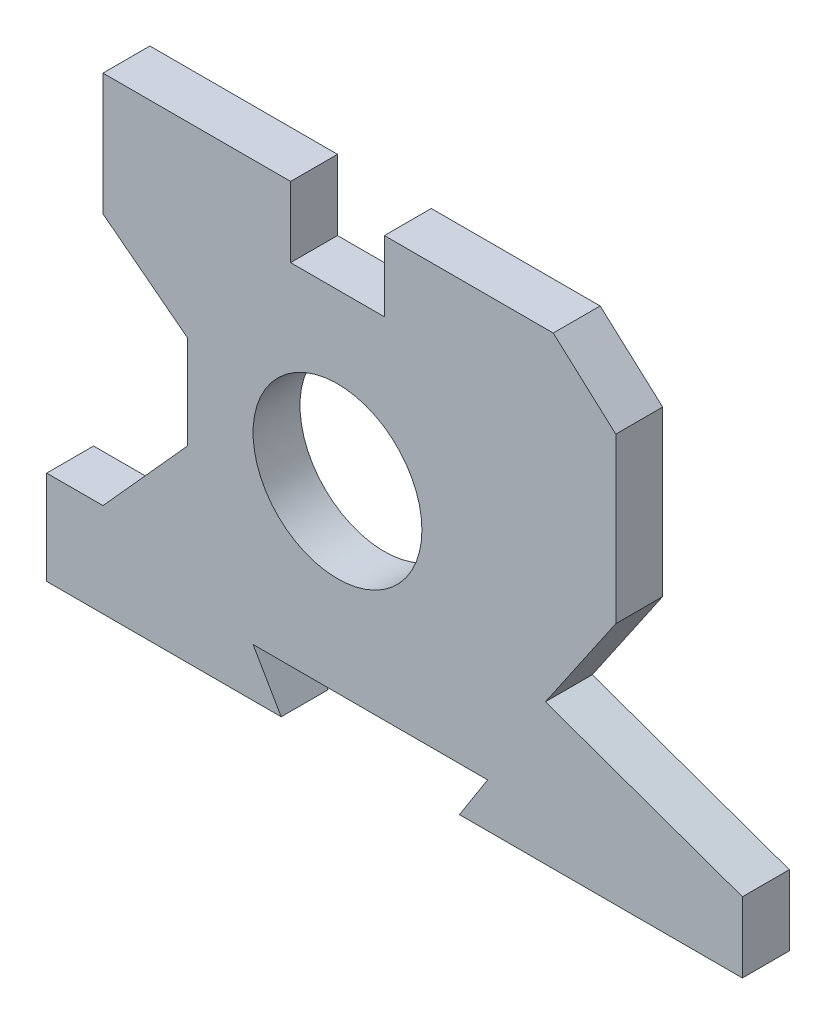
ISO-10303-21;
HEADER;
FILE_DESCRIPTION(('STEP AP214'),'2;1');
FILE_NAME('part.step','',(''),(''),'','','');
FILE_SCHEMA(('AUTOMOTIVE_DESIGN { 1 0 10303 214 1 1 1 1 }'));
ENDSEC;
DATA;
#1=APPLICATION_CONTEXT('core data for automotive mechanical design processes');
#2=APPLICATION_PROTOCOL_DEFINITION('international standard','automotive_design',2000,#1);
#3=PRODUCT_CONTEXT('',#1,'mechanical');
#4=PRODUCT('Part','Part','',(#3));
#5=PRODUCT_RELATED_PRODUCT_CATEGORY('part','',(#4));
#6=PRODUCT_DEFINITION_FORMATION('','',#4);
#7=PRODUCT_DEFINITION_CONTEXT('part definition',#1,'design');
#8=PRODUCT_DEFINITION('design','',#6,#7);
#9=PRODUCT_DEFINITION_SHAPE('','',#8);
#10=(LENGTH_UNIT() NAMED_UNIT(*) SI_UNIT(.MILLI.,.METRE.));
#11=(NAMED_UNIT(*) PLANE_ANGLE_UNIT() SI_UNIT($,.RADIAN.));
#12=(NAMED_UNIT(*) SI_UNIT($,.STERADIAN.) SOLID_ANGLE_UNIT());
#13=UNCERTAINTY_MEASURE_WITH_UNIT(LENGTH_MEASURE(1.E-05),#10,'distance_accuracy_value','');
#14=(GEOMETRIC_REPRESENTATION_CONTEXT(3) GLOBAL_UNCERTAINTY_ASSIGNED_CONTEXT((#13)) GLOBAL_UNIT_ASSIGNED_CONTEXT((#10,
#11,#12)) REPRESENTATION_CONTEXT('',''));
#15=CARTESIAN_POINT('',(0.,0.,0.));
#16=DIRECTION('',(0.,0.,1.));
#17=DIRECTION('',(1.,0.,0.));
#18=AXIS2_PLACEMENT_3D('',#15,#16,#17);
#19=CARTESIAN_POINT('',(0.,0.,10.));
#20=DIRECTION('',(0.,0.,1.));
#21=DIRECTION('',(1.,0.,0.));
#22=AXIS2_PLACEMENT_3D('',#19,#20,#21);
#23=PLANE('',#22);
#24=DIRECTION('',(0.,-1.,0.));
#25=VECTOR('',#24,1.);
#26=CARTESIAN_POINT('',(77.7532844769341,-32.225403836595,10.));
#27=LINE('',#26,#25);
#28=CARTESIAN_POINT('',(77.7532844769341,-32.225403836595,10.));
#29=VERTEX_POINT('',#28);
#30=CARTESIAN_POINT('',(77.7532844769341,-47.225403836595,10.));
#31=VERTEX_POINT('',#30);
#32=EDGE_CURVE('E359',#29,#31,#27,.T.);
#33=ORIENTED_EDGE('',*,*,#32,.F.);
#34=DIRECTION('',(-0.941741911594837,0.336336396998156,0.));
#35=VECTOR('',#34,1.);
#36=CARTESIAN_POINT('',(77.7532844769341,-32.225403836595,10.));
#37=LINE('',#36,#35);
#38=CARTESIAN_POINT('',(35.7532844769341,-17.225403836595,10.));
#39=VERTEX_POINT('',#38);
#40=EDGE_CURVE('E260',#29,#39,#37,.T.);
#41=ORIENTED_EDGE('',*,*,#40,.T.);
#42=DIRECTION('',(0.56473790190651,0.825270320652714,0.));
#43=VECTOR('',#42,1.);
#44=CARTESIAN_POINT('',(35.7532844769341,-17.225403836595,10.));
#45=LINE('',#44,#43);
#46=CARTESIAN_POINT('',(50.7532844769341,4.69459616340504,10.));
#47=VERTEX_POINT('',#46);
#48=EDGE_CURVE('E254',#39,#47,#45,.T.);
#49=ORIENTED_EDGE('',*,*,#48,.T.);
#50=DIRECTION('',(0.,1.,0.));
#51=VECTOR('',#50,1.);
#52=CARTESIAN_POINT('',(50.7532844769341,4.69459616340504,10.));
#53=LINE('',#52,#51);
#54=CARTESIAN_POINT('',(50.7532844769341,39.694596163405,10.));
#55=VERTEX_POINT('',#54);
#56=EDGE_CURVE('E258',#47,#55,#53,.T.);
#57=ORIENTED_EDGE('',*,*,#56,.T.);
#58=DIRECTION('',(-0.743210970416409,0.669057137659183,0.));
#59=VECTOR('',#58,1.);
#60=CARTESIAN_POINT('',(50.7532844769341,39.694596163405,10.));
#61=LINE('',#60,#59);
#62=CARTESIAN_POINT('',(37.4232844769341,51.694596163405,10.));
#63=VERTEX_POINT('',#62);
#64=EDGE_CURVE('E278',#55,#63,#61,.T.);
#65=ORIENTED_EDGE('',*,*,#64,.T.);
#66=DIRECTION('',(1.,0.,0.));
#67=VECTOR('',#66,1.);
#68=CARTESIAN_POINT('',(1.42328447693412,51.694596163405,10.));
#69=LINE('',#68,#67);
#70=CARTESIAN_POINT('',(1.42328447693412,51.694596163405,10.));
#71=VERTEX_POINT('',#70);
#72=EDGE_CURVE('E281',#71,#63,#69,.T.);
#73=ORIENTED_EDGE('',*,*,#72,.F.);
#74=DIRECTION('',(0.,-1.,0.));
#75=VECTOR('',#74,1.);
#76=CARTESIAN_POINT('',(1.42328447693412,51.694596163405,10.));
#77=LINE('',#76,#75);
#78=CARTESIAN_POINT('',(1.42328447693412,36.694596163405,10.));
#79=VERTEX_POINT('',#78);
#80=EDGE_CURVE('E434',#71,#79,#77,.T.);
#81=ORIENTED_EDGE('',*,*,#80,.T.);
#82=DIRECTION('',(-1.,0.,0.));
#83=VECTOR('',#82,1.);
#84=CARTESIAN_POINT('',(1.42328447693412,36.694596163405,10.));
#85=LINE('',#84,#83);
#86=CARTESIAN_POINT('',(-18.5767155230659,36.694596163405,10.));
#87=VERTEX_POINT('',#86);
#88=EDGE_CURVE('E439',#79,#87,#85,.T.);
#89=ORIENTED_EDGE('',*,*,#88,.T.);
#90=DIRECTION('',(0.,-1.,0.));
#91=VECTOR('',#90,1.);
#92=CARTESIAN_POINT('',(-18.5767155230659,51.694596163405,10.));
#93=LINE('',#92,#91);
#94=CARTESIAN_POINT('',(-18.5767155230659,51.694596163405,10.));
#95=VERTEX_POINT('',#94);
#96=EDGE_CURVE('E444',#95,#87,#93,.T.);
#97=ORIENTED_EDGE('',*,*,#96,.F.);
#98=DIRECTION('',(1.,0.,0.));
#99=VECTOR('',#98,1.);
#100=CARTESIAN_POINT('',(-58.5767155230659,51.694596163405,10.));
#101=LINE('',#100,#99);
#102=CARTESIAN_POINT('',(-58.5767155230659,51.694596163405,10.));
#103=VERTEX_POINT('',#102);
#104=EDGE_CURVE('E448',#103,#95,#101,.T.);
#105=ORIENTED_EDGE('',*,*,#104,.F.);
#106=DIRECTION('',(0.,-1.,0.));
#107=VECTOR('',#106,1.);
#108=CARTESIAN_POINT('',(-58.5767155230659,51.694596163405,10.));
#109=LINE('',#108,#107);
#110=CARTESIAN_POINT('',(-58.5767155230659,25.694596163405,10.));
#111=VERTEX_POINT('',#110);
#112=EDGE_CURVE('E452',#103,#111,#109,.T.);
#113=ORIENTED_EDGE('',*,*,#112,.T.);
#114=DIRECTION('',(-0.792333546998582,0.610088149614992,0.));
#115=VECTOR('',#114,1.);
#116=CARTESIAN_POINT('',(-40.5767155230659,11.8347933888426,10.));
#117=LINE('',#116,#115);
#118=CARTESIAN_POINT('',(-40.5767155230659,11.8347933888426,10.));
#119=VERTEX_POINT('',#118);
#120=EDGE_CURVE('E455',#119,#111,#117,.T.);
#121=ORIENTED_EDGE('',*,*,#120,.F.);
#122=DIRECTION('',(0.,1.,0.));
#123=VECTOR('',#122,1.);
#124=CARTESIAN_POINT('',(-40.5767155230659,-8.16520661115742,10.));
#125=LINE('',#124,#123);
#126=CARTESIAN_POINT('',(-40.5767155230659,-8.16520661115742,10.));
#127=VERTEX_POINT('',#126);
#128=EDGE_CURVE('E459',#127,#119,#125,.T.);
#129=ORIENTED_EDGE('',*,*,#128,.F.);
#130=DIRECTION('',(0.66896473162245,0.743294146247166,0.));
#131=VECTOR('',#130,1.);
#132=CARTESIAN_POINT('',(-58.5767155230659,-28.1652066111574,10.));
#133=LINE('',#132,#131);
#134=CARTESIAN_POINT('',(-58.5767155230659,-28.1652066111574,10.));
#135=VERTEX_POINT('',#134);
#136=EDGE_CURVE('E463',#135,#127,#133,.T.);
#137=ORIENTED_EDGE('',*,*,#136,.F.);
#138=DIRECTION('',(-1.,0.,0.));
#139=VECTOR('',#138,1.);
#140=CARTESIAN_POINT('',(-58.5767155230659,-28.1652066111574,10.));
#141=LINE('',#140,#139);
#142=CARTESIAN_POINT('',(-70.5767155230659,-28.1652066111574,10.));
#143=VERTEX_POINT('',#142);
#144=EDGE_CURVE('E467',#135,#143,#141,.T.);
#145=ORIENTED_EDGE('',*,*,#144,.T.);
#146=DIRECTION('',(0.,-1.,0.));
#147=VECTOR('',#146,1.);
#148=CARTESIAN_POINT('',(-70.5767155230659,-28.1652066111574,10.));
#149=LINE('',#148,#147);
#150=CARTESIAN_POINT('',(-70.5767155230659,-48.1652066111574,10.));
#151=VERTEX_POINT('',#150);
#152=EDGE_CURVE('E470',#143,#151,#149,.T.);
#153=ORIENTED_EDGE('',*,*,#152,.T.);
#154=DIRECTION('',(1.,0.,0.));
#155=VECTOR('',#154,1.);
#156=CARTESIAN_POINT('',(-70.5767155230659,-48.1652066111574,10.));
#157=LINE('',#156,#155);
#158=CARTESIAN_POINT('',(-20.5767155230659,-48.1652066111574,10.));
#159=VERTEX_POINT('',#158);
#160=EDGE_CURVE('E473',#151,#159,#157,.T.);
#161=ORIENTED_EDGE('',*,*,#160,.T.);
#162=DIRECTION('',(-0.501175113188044,0.865345888024524,0.));
#163=VECTOR('',#162,1.);
#164=CARTESIAN_POINT('',(-20.5767155230659,-48.1652066111574,10.));
#165=LINE('',#164,#163);
#166=CARTESIAN_POINT('',(-26.5767155230659,-37.805403836595,10.));
#167=VERTEX_POINT('',#166);
#168=EDGE_CURVE('E476',#159,#167,#165,.T.);
#169=ORIENTED_EDGE('',*,*,#168,.T.);
#170=DIRECTION('',(1.,0.,0.));
#171=VECTOR('',#170,1.);
#172=CARTESIAN_POINT('',(-26.5767155230659,-37.805403836595,10.));
#173=LINE('',#172,#171);
#174=CARTESIAN_POINT('',(23.4232844769341,-37.805403836595,10.));
#175=VERTEX_POINT('',#174);
#176=EDGE_CURVE('E479',#167,#175,#173,.T.);
#177=ORIENTED_EDGE('',*,*,#176,.T.);
#178=DIRECTION('',(-0.537223061542716,-0.843440206622064,0.));
#179=VECTOR('',#178,1.);
#180=CARTESIAN_POINT('',(23.4232844769341,-37.805403836595,10.));
#181=LINE('',#180,#179);
#182=CARTESIAN_POINT('',(17.4232844769341,-47.225403836595,10.));
#183=VERTEX_POINT('',#182);
#184=EDGE_CURVE('E482',#175,#183,#181,.T.);
#185=ORIENTED_EDGE('',*,*,#184,.T.);
#186=DIRECTION('',(1.,0.,0.));
#187=VECTOR('',#186,1.);
#188=CARTESIAN_POINT('',(17.4232844769341,-47.225403836595,10.));
#189=LINE('',#188,#187);
#190=EDGE_CURVE('E201',#183,#31,#189,.T.);
#191=ORIENTED_EDGE('',*,*,#190,.T.);
#192=EDGE_LOOP('',(#33,#41,#49,#57,#65,#73,#81,#89,#97,#105,#113,#121,#129,#137,#145,#153,#161,
#169,#177,#185,#191));
#193=FACE_BOUND('',#192,.T.);
#194=CARTESIAN_POINT('',(-8.57671552306588,1.33479338884258,10.));
#195=DIRECTION('',(0.,0.,1.));
#196=DIRECTION('',(1.,0.,0.));
#197=AXIS2_PLACEMENT_3D('',#194,#195,#196);
#198=CIRCLE('',#197,18.);
#199=CARTESIAN_POINT('',(9.42328447693412,1.33479338884258,10.));
#200=VERTEX_POINT('',#199);
#201=EDGE_CURVE('E292',#200,#200,#198,.T.);
#202=ORIENTED_EDGE('',*,*,#201,.F.);
#203=EDGE_LOOP('',(#202));
#204=FACE_BOUND('',#203,.T.);
#205=ADVANCED_FACE('F105',(#193,#204),#23,.T.);
#206=CARTESIAN_POINT('',(0.,0.,0.));
#207=DIRECTION('',(0.,0.,1.));
#208=DIRECTION('',(1.,0.,0.));
#209=AXIS2_PLACEMENT_3D('',#206,#207,#208);
#210=PLANE('',#209);
#211=DIRECTION('',(0.,-1.,0.));
#212=VECTOR('',#211,1.);
#213=CARTESIAN_POINT('',(77.7532844769341,-32.225403836595,0.));
#214=LINE('',#213,#212);
#215=CARTESIAN_POINT('',(77.7532844769341,-32.225403836595,0.));
#216=VERTEX_POINT('',#215);
#217=CARTESIAN_POINT('',(77.7532844769341,-47.225403836595,0.));
#218=VERTEX_POINT('',#217);
#219=EDGE_CURVE('E287',#216,#218,#214,.T.);
#220=ORIENTED_EDGE('',*,*,#219,.T.);
#221=DIRECTION('',(1.,0.,0.));
#222=VECTOR('',#221,1.);
#223=CARTESIAN_POINT('',(17.4232844769341,-47.225403836595,0.));
#224=LINE('',#223,#222);
#225=CARTESIAN_POINT('',(17.4232844769341,-47.225403836595,0.));
#226=VERTEX_POINT('',#225);
#227=EDGE_CURVE('E291',#226,#218,#224,.T.);
#228=ORIENTED_EDGE('',*,*,#227,.F.);
#229=DIRECTION('',(-0.537223061542716,-0.843440206622064,0.));
#230=VECTOR('',#229,1.);
#231=CARTESIAN_POINT('',(23.4232844769341,-37.805403836595,0.));
#232=LINE('',#231,#230);
#233=CARTESIAN_POINT('',(23.4232844769341,-37.805403836595,0.));
#234=VERTEX_POINT('',#233);
#235=EDGE_CURVE('E296',#234,#226,#232,.T.);
#236=ORIENTED_EDGE('',*,*,#235,.F.);
#237=DIRECTION('',(1.,0.,0.));
#238=VECTOR('',#237,1.);
#239=CARTESIAN_POINT('',(-26.5767155230659,-37.805403836595,0.));
#240=LINE('',#239,#238);
#241=CARTESIAN_POINT('',(-26.5767155230659,-37.805403836595,0.));
#242=VERTEX_POINT('',#241);
#243=EDGE_CURVE('E299',#242,#234,#240,.T.);
#244=ORIENTED_EDGE('',*,*,#243,.F.);
#245=DIRECTION('',(-0.501175113188044,0.865345888024524,0.));
#246=VECTOR('',#245,1.);
#247=CARTESIAN_POINT('',(-20.5767155230659,-48.1652066111574,0.));
#248=LINE('',#247,#246);
#249=CARTESIAN_POINT('',(-20.5767155230659,-48.1652066111574,0.));
#250=VERTEX_POINT('',#249);
#251=EDGE_CURVE('E302',#250,#242,#248,.T.);
#252=ORIENTED_EDGE('',*,*,#251,.F.);
#253=DIRECTION('',(1.,0.,0.));
#254=VECTOR('',#253,1.);
#255=CARTESIAN_POINT('',(-70.5767155230659,-48.1652066111574,0.));
#256=LINE('',#255,#254);
#257=CARTESIAN_POINT('',(-70.5767155230659,-48.1652066111574,0.));
#258=VERTEX_POINT('',#257);
#259=EDGE_CURVE('E305',#258,#250,#256,.T.);
#260=ORIENTED_EDGE('',*,*,#259,.F.);
#261=DIRECTION('',(0.,-1.,0.));
#262=VECTOR('',#261,1.);
#263=CARTESIAN_POINT('',(-70.5767155230659,-28.1652066111574,0.));
#264=LINE('',#263,#262);
#265=CARTESIAN_POINT('',(-70.5767155230659,-28.1652066111574,0.));
#266=VERTEX_POINT('',#265);
#267=EDGE_CURVE('E308',#266,#258,#264,.T.);
#268=ORIENTED_EDGE('',*,*,#267,.F.);
#269=DIRECTION('',(-1.,0.,0.));
#270=VECTOR('',#269,1.);
#271=CARTESIAN_POINT('',(-58.5767155230659,-28.1652066111574,0.));
#272=LINE('',#271,#270);
#273=CARTESIAN_POINT('',(-58.5767155230659,-28.1652066111574,0.));
#274=VERTEX_POINT('',#273);
#275=EDGE_CURVE('E311',#274,#266,#272,.T.);
#276=ORIENTED_EDGE('',*,*,#275,.F.);
#277=DIRECTION('',(0.66896473162245,0.743294146247166,0.));
#278=VECTOR('',#277,1.);
#279=CARTESIAN_POINT('',(-58.5767155230659,-28.1652066111574,0.));
#280=LINE('',#279,#278);
#281=CARTESIAN_POINT('',(-40.5767155230659,-8.16520661115742,0.));
#282=VERTEX_POINT('',#281);
#283=EDGE_CURVE('E314',#274,#282,#280,.T.);
#284=ORIENTED_EDGE('',*,*,#283,.T.);
#285=DIRECTION('',(0.,1.,0.));
#286=VECTOR('',#285,1.);
#287=CARTESIAN_POINT('',(-40.5767155230659,-8.16520661115742,0.));
#288=LINE('',#287,#286);
#289=CARTESIAN_POINT('',(-40.5767155230659,11.8347933888426,0.));
#290=VERTEX_POINT('',#289);
#291=EDGE_CURVE('E318',#282,#290,#288,.T.);
#292=ORIENTED_EDGE('',*,*,#291,.T.);
#293=DIRECTION('',(-0.792333546998582,0.610088149614992,0.));
#294=VECTOR('',#293,1.);
#295=CARTESIAN_POINT('',(-40.5767155230659,11.8347933888426,0.));
#296=LINE('',#295,#294);
#297=CARTESIAN_POINT('',(-58.5767155230659,25.694596163405,0.));
#298=VERTEX_POINT('',#297);
#299=EDGE_CURVE('E322',#290,#298,#296,.T.);
#300=ORIENTED_EDGE('',*,*,#299,.T.);
#301=DIRECTION('',(0.,-1.,0.));
#302=VECTOR('',#301,1.);
#303=CARTESIAN_POINT('',(-58.5767155230659,51.694596163405,0.));
#304=LINE('',#303,#302);
#305=CARTESIAN_POINT('',(-58.5767155230659,51.694596163405,0.));
#306=VERTEX_POINT('',#305);
#307=EDGE_CURVE('E326',#306,#298,#304,.T.);
#308=ORIENTED_EDGE('',*,*,#307,.F.);
#309=DIRECTION('',(1.,0.,0.));
#310=VECTOR('',#309,1.);
#311=CARTESIAN_POINT('',(-58.5767155230659,51.694596163405,0.));
#312=LINE('',#311,#310);
#313=CARTESIAN_POINT('',(-18.5767155230659,51.694596163405,0.));
#314=VERTEX_POINT('',#313);
#315=EDGE_CURVE('E330',#306,#314,#312,.T.);
#316=ORIENTED_EDGE('',*,*,#315,.T.);
#317=DIRECTION('',(0.,-1.,0.));
#318=VECTOR('',#317,1.);
#319=CARTESIAN_POINT('',(-18.5767155230659,51.694596163405,0.));
#320=LINE('',#319,#318);
#321=CARTESIAN_POINT('',(-18.5767155230659,36.694596163405,0.));
#322=VERTEX_POINT('',#321);
#323=EDGE_CURVE('E334',#314,#322,#320,.T.);
#324=ORIENTED_EDGE('',*,*,#323,.T.);
#325=DIRECTION('',(-1.,0.,0.));
#326=VECTOR('',#325,1.);
#327=CARTESIAN_POINT('',(1.42328447693412,36.694596163405,0.));
#328=LINE('',#327,#326);
#329=CARTESIAN_POINT('',(1.42328447693412,36.694596163405,0.));
#330=VERTEX_POINT('',#329);
#331=EDGE_CURVE('E338',#330,#322,#328,.T.);
#332=ORIENTED_EDGE('',*,*,#331,.F.);
#333=DIRECTION('',(0.,-1.,0.));
#334=VECTOR('',#333,1.);
#335=CARTESIAN_POINT('',(1.42328447693412,51.694596163405,0.));
#336=LINE('',#335,#334);
#337=CARTESIAN_POINT('',(1.42328447693412,51.694596163405,0.));
#338=VERTEX_POINT('',#337);
#339=EDGE_CURVE('E342',#338,#330,#336,.T.);
#340=ORIENTED_EDGE('',*,*,#339,.F.);
#341=DIRECTION('',(1.,0.,0.));
#342=VECTOR('',#341,1.);
#343=CARTESIAN_POINT('',(1.42328447693412,51.694596163405,0.));
#344=LINE('',#343,#342);
#345=CARTESIAN_POINT('',(37.4232844769341,51.694596163405,0.));
#346=VERTEX_POINT('',#345);
#347=EDGE_CURVE('E345',#338,#346,#344,.T.);
#348=ORIENTED_EDGE('',*,*,#347,.T.);
#349=DIRECTION('',(-0.743210970416409,0.669057137659183,0.));
#350=VECTOR('',#349,1.);
#351=CARTESIAN_POINT('',(50.7532844769341,39.694596163405,0.));
#352=LINE('',#351,#350);
#353=CARTESIAN_POINT('',(50.7532844769341,39.694596163405,0.));
#354=VERTEX_POINT('',#353);
#355=EDGE_CURVE('E349',#354,#346,#352,.T.);
#356=ORIENTED_EDGE('',*,*,#355,.F.);
#357=DIRECTION('',(0.,1.,0.));
#358=VECTOR('',#357,1.);
#359=CARTESIAN_POINT('',(50.7532844769341,4.69459616340504,0.));
#360=LINE('',#359,#358);
#361=CARTESIAN_POINT('',(50.7532844769341,4.69459616340504,0.));
#362=VERTEX_POINT('',#361);
#363=EDGE_CURVE('E353',#362,#354,#360,.T.);
#364=ORIENTED_EDGE('',*,*,#363,.F.);
#365=DIRECTION('',(0.56473790190651,0.825270320652714,0.));
#366=VECTOR('',#365,1.);
#367=CARTESIAN_POINT('',(35.7532844769341,-17.225403836595,0.));
#368=LINE('',#367,#366);
#369=CARTESIAN_POINT('',(35.7532844769341,-17.225403836595,0.));
#370=VERTEX_POINT('',#369);
#371=EDGE_CURVE('E268',#370,#362,#368,.T.);
#372=ORIENTED_EDGE('',*,*,#371,.F.);
#373=DIRECTION('',(-0.941741911594837,0.336336396998156,0.));
#374=VECTOR('',#373,1.);
#375=CARTESIAN_POINT('',(77.7532844769341,-32.225403836595,0.));
#376=LINE('',#375,#374);
#377=EDGE_CURVE('E191',#216,#370,#376,.T.);
#378=ORIENTED_EDGE('',*,*,#377,.F.);
#379=EDGE_LOOP('',(#220,#228,#236,#244,#252,#260,#268,#276,#284,#292,#300,#308,#316,#324,#332,
#340,#348,#356,#364,#372,#378));
#380=FACE_BOUND('',#379,.T.);
#381=CARTESIAN_POINT('',(-8.57671552306588,1.33479338884258,0.));
#382=DIRECTION('',(0.,0.,1.));
#383=DIRECTION('',(1.,0.,0.));
#384=AXIS2_PLACEMENT_3D('',#381,#382,#383);
#385=CIRCLE('',#384,18.);
#386=CARTESIAN_POINT('',(9.42328447693412,1.33479338884258,0.));
#387=VERTEX_POINT('',#386);
#388=EDGE_CURVE('E489',#387,#387,#385,.T.);
#389=ORIENTED_EDGE('',*,*,#388,.T.);
#390=EDGE_LOOP('',(#389));
#391=FACE_BOUND('',#390,.T.);
#392=ADVANCED_FACE('F425',(#380,#391),#210,.F.);
#393=CARTESIAN_POINT('',(77.7532844769341,-32.225403836595,10.));
#394=DIRECTION('',(1.,0.,0.));
#395=DIRECTION('',(0.,0.,-1.));
#396=AXIS2_PLACEMENT_3D('',#393,#394,#395);
#397=PLANE('',#396);
#398=ORIENTED_EDGE('',*,*,#219,.F.);
#399=DIRECTION('',(0.,0.,-1.));
#400=VECTOR('',#399,1.);
#401=CARTESIAN_POINT('',(77.7532844769341,-32.225403836595,10.));
#402=LINE('',#401,#400);
#403=EDGE_CURVE('E12',#29,#216,#402,.T.);
#404=ORIENTED_EDGE('',*,*,#403,.F.);
#405=ORIENTED_EDGE('',*,*,#32,.T.);
#406=DIRECTION('',(0.,0.,-1.));
#407=VECTOR('',#406,1.);
#408=CARTESIAN_POINT('',(77.7532844769341,-47.225403836595,10.));
#409=LINE('',#408,#407);
#410=EDGE_CURVE('E109',#31,#218,#409,.T.);
#411=ORIENTED_EDGE('',*,*,#410,.T.);
#412=EDGE_LOOP('',(#398,#404,#405,#411));
#413=FACE_BOUND('',#412,.T.);
#414=ADVANCED_FACE('F107',(#413),#397,.T.);
#415=CARTESIAN_POINT('',(77.7532844769341,-32.225403836595,10.));
#416=DIRECTION('',(-0.336336396998156,-0.941741911594837,0.));
#417=DIRECTION('',(0.941741911594837,-0.336336396998156,0.));
#418=AXIS2_PLACEMENT_3D('',#415,#416,#417);
#419=PLANE('',#418);
#420=ORIENTED_EDGE('',*,*,#377,.T.);
#421=DIRECTION('',(0.,0.,-1.));
#422=VECTOR('',#421,1.);
#423=CARTESIAN_POINT('',(35.7532844769341,-17.225403836595,10.));
#424=LINE('',#423,#422);
#425=EDGE_CURVE('E116',#39,#370,#424,.T.);
#426=ORIENTED_EDGE('',*,*,#425,.F.);
#427=ORIENTED_EDGE('',*,*,#40,.F.);
#428=ORIENTED_EDGE('',*,*,#403,.T.);
#429=EDGE_LOOP('',(#420,#426,#427,#428));
#430=FACE_BOUND('',#429,.T.);
#431=ADVANCED_FACE('F507',(#430),#419,.F.);
#432=CARTESIAN_POINT('',(35.7532844769341,-17.225403836595,10.));
#433=DIRECTION('',(-0.825270320652714,0.56473790190651,0.));
#434=DIRECTION('',(-0.56473790190651,-0.825270320652714,0.));
#435=AXIS2_PLACEMENT_3D('',#432,#433,#434);
#436=PLANE('',#435);
#437=ORIENTED_EDGE('',*,*,#371,.T.);
#438=DIRECTION('',(0.,0.,-1.));
#439=VECTOR('',#438,1.);
#440=CARTESIAN_POINT('',(50.7532844769341,4.69459616340504,10.));
#441=LINE('',#440,#439);
#442=EDGE_CURVE('E265',#47,#362,#441,.T.);
#443=ORIENTED_EDGE('',*,*,#442,.F.);
#444=ORIENTED_EDGE('',*,*,#48,.F.);
#445=ORIENTED_EDGE('',*,*,#425,.T.);
#446=EDGE_LOOP('',(#437,#443,#444,#445));
#447=FACE_BOUND('',#446,.T.);
#448=ADVANCED_FACE('F266',(#447),#436,.F.);
#449=CARTESIAN_POINT('',(50.7532844769341,4.69459616340504,10.));
#450=DIRECTION('',(-1.,0.,0.));
#451=DIRECTION('',(0.,0.,1.));
#452=AXIS2_PLACEMENT_3D('',#449,#450,#451);
#453=PLANE('',#452);
#454=ORIENTED_EDGE('',*,*,#363,.T.);
#455=DIRECTION('',(0.,0.,-1.));
#456=VECTOR('',#455,1.);
#457=CARTESIAN_POINT('',(50.7532844769341,39.694596163405,10.));
#458=LINE('',#457,#456);
#459=EDGE_CURVE('E272',#55,#354,#458,.T.);
#460=ORIENTED_EDGE('',*,*,#459,.F.);
#461=ORIENTED_EDGE('',*,*,#56,.F.);
#462=ORIENTED_EDGE('',*,*,#442,.T.);
#463=EDGE_LOOP('',(#454,#460,#461,#462));
#464=FACE_BOUND('',#463,.T.);
#465=ADVANCED_FACE('F274',(#464),#453,.F.);
#466=CARTESIAN_POINT('',(50.7532844769341,39.694596163405,10.));
#467=DIRECTION('',(-0.669057137659183,-0.74321097041641,0.));
#468=DIRECTION('',(0.74321097041641,-0.669057137659183,0.));
#469=AXIS2_PLACEMENT_3D('',#466,#467,#468);
#470=PLANE('',#469);
#471=ORIENTED_EDGE('',*,*,#355,.T.);
#472=DIRECTION('',(0.,0.,-1.));
#473=VECTOR('',#472,1.);
#474=CARTESIAN_POINT('',(37.4232844769341,51.694596163405,10.));
#475=LINE('',#474,#473);
#476=EDGE_CURVE('E365',#63,#346,#475,.T.);
#477=ORIENTED_EDGE('',*,*,#476,.F.);
#478=ORIENTED_EDGE('',*,*,#64,.F.);
#479=ORIENTED_EDGE('',*,*,#459,.T.);
#480=EDGE_LOOP('',(#471,#477,#478,#479));
#481=FACE_BOUND('',#480,.T.);
#482=ADVANCED_FACE('F429',(#481),#470,.F.);
#483=CARTESIAN_POINT('',(1.42328447693412,51.694596163405,10.));
#484=DIRECTION('',(0.,1.,0.));
#485=DIRECTION('',(0.,0.,1.));
#486=AXIS2_PLACEMENT_3D('',#483,#484,#485);
#487=PLANE('',#486);
#488=ORIENTED_EDGE('',*,*,#347,.F.);
#489=DIRECTION('',(0.,0.,-1.));
#490=VECTOR('',#489,1.);
#491=CARTESIAN_POINT('',(1.42328447693412,51.694596163405,10.));
#492=LINE('',#491,#490);
#493=EDGE_CURVE('E368',#71,#338,#492,.T.);
#494=ORIENTED_EDGE('',*,*,#493,.F.);
#495=ORIENTED_EDGE('',*,*,#72,.T.);
#496=ORIENTED_EDGE('',*,*,#476,.T.);
#497=EDGE_LOOP('',(#488,#494,#495,#496));
#498=FACE_BOUND('',#497,.T.);
#499=ADVANCED_FACE('F516',(#498),#487,.T.);
#500=CARTESIAN_POINT('',(1.42328447693412,51.694596163405,10.));
#501=DIRECTION('',(1.,0.,0.));
#502=DIRECTION('',(0.,0.,-1.));
#503=AXIS2_PLACEMENT_3D('',#500,#501,#502);
#504=PLANE('',#503);
#505=ORIENTED_EDGE('',*,*,#339,.T.);
#506=DIRECTION('',(0.,0.,-1.));
#507=VECTOR('',#506,1.);
#508=CARTESIAN_POINT('',(1.42328447693412,36.694596163405,10.));
#509=LINE('',#508,#507);
#510=EDGE_CURVE('E371',#79,#330,#509,.T.);
#511=ORIENTED_EDGE('',*,*,#510,.F.);
#512=ORIENTED_EDGE('',*,*,#80,.F.);
#513=ORIENTED_EDGE('',*,*,#493,.T.);
#514=EDGE_LOOP('',(#505,#511,#512,#513));
#515=FACE_BOUND('',#514,.T.);
#516=ADVANCED_FACE('F519',(#515),#504,.F.);
#517=CARTESIAN_POINT('',(1.42328447693412,36.694596163405,10.));
#518=DIRECTION('',(0.,-1.,0.));
#519=DIRECTION('',(0.,0.,-1.));
#520=AXIS2_PLACEMENT_3D('',#517,#518,#519);
#521=PLANE('',#520);
#522=ORIENTED_EDGE('',*,*,#331,.T.);
#523=DIRECTION('',(0.,0.,-1.));
#524=VECTOR('',#523,1.);
#525=CARTESIAN_POINT('',(-18.5767155230659,36.694596163405,10.));
#526=LINE('',#525,#524);
#527=EDGE_CURVE('E375',#87,#322,#526,.T.);
#528=ORIENTED_EDGE('',*,*,#527,.F.);
#529=ORIENTED_EDGE('',*,*,#88,.F.);
#530=ORIENTED_EDGE('',*,*,#510,.T.);
#531=EDGE_LOOP('',(#522,#528,#529,#530));
#532=FACE_BOUND('',#531,.T.);
#533=ADVANCED_FACE('F522',(#532),#521,.F.);
#534=CARTESIAN_POINT('',(-18.5767155230659,51.694596163405,10.));
#535=DIRECTION('',(1.,0.,0.));
#536=DIRECTION('',(0.,0.,-1.));
#537=AXIS2_PLACEMENT_3D('',#534,#535,#536);
#538=PLANE('',#537);
#539=ORIENTED_EDGE('',*,*,#323,.F.);
#540=DIRECTION('',(0.,0.,-1.));
#541=VECTOR('',#540,1.);
#542=CARTESIAN_POINT('',(-18.5767155230659,51.694596163405,10.));
#543=LINE('',#542,#541);
#544=EDGE_CURVE('E378',#95,#314,#543,.T.);
#545=ORIENTED_EDGE('',*,*,#544,.F.);
#546=ORIENTED_EDGE('',*,*,#96,.T.);
#547=ORIENTED_EDGE('',*,*,#527,.T.);
#548=EDGE_LOOP('',(#539,#545,#546,#547));
#549=FACE_BOUND('',#548,.T.);
#550=ADVANCED_FACE('F526',(#549),#538,.T.);
#551=CARTESIAN_POINT('',(-58.5767155230659,51.694596163405,10.));
#552=DIRECTION('',(0.,1.,0.));
#553=DIRECTION('',(-1.,0.,0.));
#554=AXIS2_PLACEMENT_3D('',#551,#552,#553);
#555=PLANE('',#554);
#556=ORIENTED_EDGE('',*,*,#315,.F.);
#557=DIRECTION('',(0.,0.,-1.));
#558=VECTOR('',#557,1.);
#559=CARTESIAN_POINT('',(-58.5767155230659,51.694596163405,10.));
#560=LINE('',#559,#558);
#561=EDGE_CURVE('E381',#103,#306,#560,.T.);
#562=ORIENTED_EDGE('',*,*,#561,.F.);
#563=ORIENTED_EDGE('',*,*,#104,.T.);
#564=ORIENTED_EDGE('',*,*,#544,.T.);
#565=EDGE_LOOP('',(#556,#562,#563,#564));
#566=FACE_BOUND('',#565,.T.);
#567=ADVANCED_FACE('F530',(#566),#555,.T.);
#568=CARTESIAN_POINT('',(-58.5767155230659,51.694596163405,10.));
#569=DIRECTION('',(1.,0.,0.));
#570=DIRECTION('',(0.,0.,-1.));
#571=AXIS2_PLACEMENT_3D('',#568,#569,#570);
#572=PLANE('',#571);
#573=ORIENTED_EDGE('',*,*,#307,.T.);
#574=DIRECTION('',(0.,0.,-1.));
#575=VECTOR('',#574,1.);
#576=CARTESIAN_POINT('',(-58.5767155230659,25.694596163405,10.));
#577=LINE('',#576,#575);
#578=EDGE_CURVE('E384',#111,#298,#577,.T.);
#579=ORIENTED_EDGE('',*,*,#578,.F.);
#580=ORIENTED_EDGE('',*,*,#112,.F.);
#581=ORIENTED_EDGE('',*,*,#561,.T.);
#582=EDGE_LOOP('',(#573,#579,#580,#581));
#583=FACE_BOUND('',#582,.T.);
#584=ADVANCED_FACE('F534',(#583),#572,.F.);
#585=CARTESIAN_POINT('',(-40.5767155230659,11.8347933888426,10.));
#586=DIRECTION('',(-0.610088149614992,-0.792333546998582,0.));
#587=DIRECTION('',(0.792333546998582,-0.610088149614992,0.));
#588=AXIS2_PLACEMENT_3D('',#585,#586,#587);
#589=PLANE('',#588);
#590=ORIENTED_EDGE('',*,*,#299,.F.);
#591=DIRECTION('',(0.,0.,-1.));
#592=VECTOR('',#591,1.);
#593=CARTESIAN_POINT('',(-40.5767155230659,11.8347933888426,10.));
#594=LINE('',#593,#592);
#595=EDGE_CURVE('E387',#119,#290,#594,.T.);
#596=ORIENTED_EDGE('',*,*,#595,.F.);
#597=ORIENTED_EDGE('',*,*,#120,.T.);
#598=ORIENTED_EDGE('',*,*,#578,.T.);
#599=EDGE_LOOP('',(#590,#596,#597,#598));
#600=FACE_BOUND('',#599,.T.);
#601=ADVANCED_FACE('F538',(#600),#589,.T.);
#602=CARTESIAN_POINT('',(-40.5767155230659,-8.16520661115742,10.));
#603=DIRECTION('',(-1.,0.,0.));
#604=DIRECTION('',(0.,-1.,0.));
#605=AXIS2_PLACEMENT_3D('',#602,#603,#604);
#606=PLANE('',#605);
#607=ORIENTED_EDGE('',*,*,#291,.F.);
#608=DIRECTION('',(0.,0.,-1.));
#609=VECTOR('',#608,1.);
#610=CARTESIAN_POINT('',(-40.5767155230659,-8.16520661115742,10.));
#611=LINE('',#610,#609);
#612=EDGE_CURVE('E390',#127,#282,#611,.T.);
#613=ORIENTED_EDGE('',*,*,#612,.F.);
#614=ORIENTED_EDGE('',*,*,#128,.T.);
#615=ORIENTED_EDGE('',*,*,#595,.T.);
#616=EDGE_LOOP('',(#607,#613,#614,#615));
#617=FACE_BOUND('',#616,.T.);
#618=ADVANCED_FACE('F542',(#617),#606,.T.);
#619=CARTESIAN_POINT('',(-58.5767155230659,-28.1652066111574,10.));
#620=DIRECTION('',(-0.743294146247166,0.66896473162245,0.));
#621=DIRECTION('',(-0.66896473162245,-0.743294146247166,0.));
#622=AXIS2_PLACEMENT_3D('',#619,#620,#621);
#623=PLANE('',#622);
#624=ORIENTED_EDGE('',*,*,#283,.F.);
#625=DIRECTION('',(0.,0.,-1.));
#626=VECTOR('',#625,1.);
#627=CARTESIAN_POINT('',(-58.5767155230659,-28.1652066111574,10.));
#628=LINE('',#627,#626);
#629=EDGE_CURVE('E393',#135,#274,#628,.T.);
#630=ORIENTED_EDGE('',*,*,#629,.F.);
#631=ORIENTED_EDGE('',*,*,#136,.T.);
#632=ORIENTED_EDGE('',*,*,#612,.T.);
#633=EDGE_LOOP('',(#624,#630,#631,#632));
#634=FACE_BOUND('',#633,.T.);
#635=ADVANCED_FACE('F546',(#634),#623,.T.);
#636=CARTESIAN_POINT('',(-58.5767155230659,-28.1652066111574,10.));
#637=DIRECTION('',(0.,-1.,0.));
#638=DIRECTION('',(0.,0.,-1.));
#639=AXIS2_PLACEMENT_3D('',#636,#637,#638);
#640=PLANE('',#639);
#641=ORIENTED_EDGE('',*,*,#275,.T.);
#642=DIRECTION('',(0.,0.,-1.));
#643=VECTOR('',#642,1.);
#644=CARTESIAN_POINT('',(-70.5767155230659,-28.1652066111574,10.));
#645=LINE('',#644,#643);
#646=EDGE_CURVE('E396',#143,#266,#645,.T.);
#647=ORIENTED_EDGE('',*,*,#646,.F.);
#648=ORIENTED_EDGE('',*,*,#144,.F.);
#649=ORIENTED_EDGE('',*,*,#629,.T.);
#650=EDGE_LOOP('',(#641,#647,#648,#649));
#651=FACE_BOUND('',#650,.T.);
#652=ADVANCED_FACE('F550',(#651),#640,.F.);
#653=CARTESIAN_POINT('',(-70.5767155230659,-28.1652066111574,10.));
#654=DIRECTION('',(1.,0.,0.));
#655=DIRECTION('',(0.,0.,-1.));
#656=AXIS2_PLACEMENT_3D('',#653,#654,#655);
#657=PLANE('',#656);
#658=ORIENTED_EDGE('',*,*,#267,.T.);
#659=DIRECTION('',(0.,0.,-1.));
#660=VECTOR('',#659,1.);
#661=CARTESIAN_POINT('',(-70.5767155230659,-48.1652066111574,10.));
#662=LINE('',#661,#660);
#663=EDGE_CURVE('E400',#151,#258,#662,.T.);
#664=ORIENTED_EDGE('',*,*,#663,.F.);
#665=ORIENTED_EDGE('',*,*,#152,.F.);
#666=ORIENTED_EDGE('',*,*,#646,.T.);
#667=EDGE_LOOP('',(#658,#664,#665,#666));
#668=FACE_BOUND('',#667,.T.);
#669=ADVANCED_FACE('F554',(#668),#657,.F.);
#670=CARTESIAN_POINT('',(-70.5767155230659,-48.1652066111574,10.));
#671=DIRECTION('',(0.,1.,0.));
#672=DIRECTION('',(0.,0.,1.));
#673=AXIS2_PLACEMENT_3D('',#670,#671,#672);
#674=PLANE('',#673);
#675=ORIENTED_EDGE('',*,*,#259,.T.);
#676=DIRECTION('',(0.,0.,-1.));
#677=VECTOR('',#676,1.);
#678=CARTESIAN_POINT('',(-20.5767155230659,-48.1652066111574,10.));
#679=LINE('',#678,#677);
#680=EDGE_CURVE('E404',#159,#250,#679,.T.);
#681=ORIENTED_EDGE('',*,*,#680,.F.);
#682=ORIENTED_EDGE('',*,*,#160,.F.);
#683=ORIENTED_EDGE('',*,*,#663,.T.);
#684=EDGE_LOOP('',(#675,#681,#682,#683));
#685=FACE_BOUND('',#684,.T.);
#686=ADVANCED_FACE('F558',(#685),#674,.F.);
#687=CARTESIAN_POINT('',(-20.5767155230659,-48.1652066111574,10.));
#688=DIRECTION('',(-0.865345888024524,-0.501175113188044,0.));
#689=DIRECTION('',(0.501175113188044,-0.865345888024524,0.));
#690=AXIS2_PLACEMENT_3D('',#687,#688,#689);
#691=PLANE('',#690);
#692=ORIENTED_EDGE('',*,*,#251,.T.);
#693=DIRECTION('',(0.,0.,-1.));
#694=VECTOR('',#693,1.);
#695=CARTESIAN_POINT('',(-26.5767155230659,-37.805403836595,10.));
#696=LINE('',#695,#694);
#697=EDGE_CURVE('E408',#167,#242,#696,.T.);
#698=ORIENTED_EDGE('',*,*,#697,.F.);
#699=ORIENTED_EDGE('',*,*,#168,.F.);
#700=ORIENTED_EDGE('',*,*,#680,.T.);
#701=EDGE_LOOP('',(#692,#698,#699,#700));
#702=FACE_BOUND('',#701,.T.);
#703=ADVANCED_FACE('F562',(#702),#691,.F.);
#704=CARTESIAN_POINT('',(-26.5767155230659,-37.805403836595,10.));
#705=DIRECTION('',(0.,1.,0.));
#706=DIRECTION('',(0.,0.,1.));
#707=AXIS2_PLACEMENT_3D('',#704,#705,#706);
#708=PLANE('',#707);
#709=ORIENTED_EDGE('',*,*,#243,.T.);
#710=DIRECTION('',(0.,0.,-1.));
#711=VECTOR('',#710,1.);
#712=CARTESIAN_POINT('',(23.4232844769341,-37.805403836595,10.));
#713=LINE('',#712,#711);
#714=EDGE_CURVE('E412',#175,#234,#713,.T.);
#715=ORIENTED_EDGE('',*,*,#714,.F.);
#716=ORIENTED_EDGE('',*,*,#176,.F.);
#717=ORIENTED_EDGE('',*,*,#697,.T.);
#718=EDGE_LOOP('',(#709,#715,#716,#717));
#719=FACE_BOUND('',#718,.T.);
#720=ADVANCED_FACE('F566',(#719),#708,.F.);
#721=CARTESIAN_POINT('',(23.4232844769341,-37.805403836595,10.));
#722=DIRECTION('',(0.843440206622064,-0.537223061542716,0.));
#723=DIRECTION('',(0.537223061542716,0.843440206622064,0.));
#724=AXIS2_PLACEMENT_3D('',#721,#722,#723);
#725=PLANE('',#724);
#726=ORIENTED_EDGE('',*,*,#235,.T.);
#727=DIRECTION('',(0.,0.,-1.));
#728=VECTOR('',#727,1.);
#729=CARTESIAN_POINT('',(17.4232844769341,-47.225403836595,10.));
#730=LINE('',#729,#728);
#731=EDGE_CURVE('E415',#183,#226,#730,.T.);
#732=ORIENTED_EDGE('',*,*,#731,.F.);
#733=ORIENTED_EDGE('',*,*,#184,.F.);
#734=ORIENTED_EDGE('',*,*,#714,.T.);
#735=EDGE_LOOP('',(#726,#732,#733,#734));
#736=FACE_BOUND('',#735,.T.);
#737=ADVANCED_FACE('F570',(#736),#725,.F.);
#738=CARTESIAN_POINT('',(17.4232844769341,-47.225403836595,10.));
#739=DIRECTION('',(0.,1.,0.));
#740=DIRECTION('',(0.,0.,1.));
#741=AXIS2_PLACEMENT_3D('',#738,#739,#740);
#742=PLANE('',#741);
#743=ORIENTED_EDGE('',*,*,#227,.T.);
#744=ORIENTED_EDGE('',*,*,#410,.F.);
#745=ORIENTED_EDGE('',*,*,#190,.F.);
#746=ORIENTED_EDGE('',*,*,#731,.T.);
#747=EDGE_LOOP('',(#743,#744,#745,#746));
#748=FACE_BOUND('',#747,.T.);
#749=ADVANCED_FACE('F422',(#748),#742,.F.);
#750=CARTESIAN_POINT('',(-8.57671552306588,1.33479338884258,10.));
#751=DIRECTION('',(0.,0.,-1.));
#752=DIRECTION('',(-1.,0.,0.));
#753=AXIS2_PLACEMENT_3D('',#750,#751,#752);
#754=CYLINDRICAL_SURFACE('',#753,18.);
#755=ORIENTED_EDGE('',*,*,#201,.T.);
#756=EDGE_LOOP('',(#755));
#757=FACE_BOUND('',#756,.T.);
#758=ORIENTED_EDGE('',*,*,#388,.F.);
#759=EDGE_LOOP('',(#758));
#760=FACE_BOUND('',#759,.T.);
#761=ADVANCED_FACE('F497',(#757,#760),#754,.F.);
#762=CLOSED_SHELL('',(#205,#392,#414,#431,#448,#465,#482,#499,#516,#533,#550,#567,#584,#601,
#618,#635,#652,#669,#686,#703,#720,#737,#749,#761));
#763=MANIFOLD_SOLID_BREP('B2',#762);
#764=ADVANCED_BREP_SHAPE_REPRESENTATION('',(#18,#763),#14);
#765=SHAPE_DEFINITION_REPRESENTATION(#9,#764);
ENDSEC;
END-ISO-10303-21;
